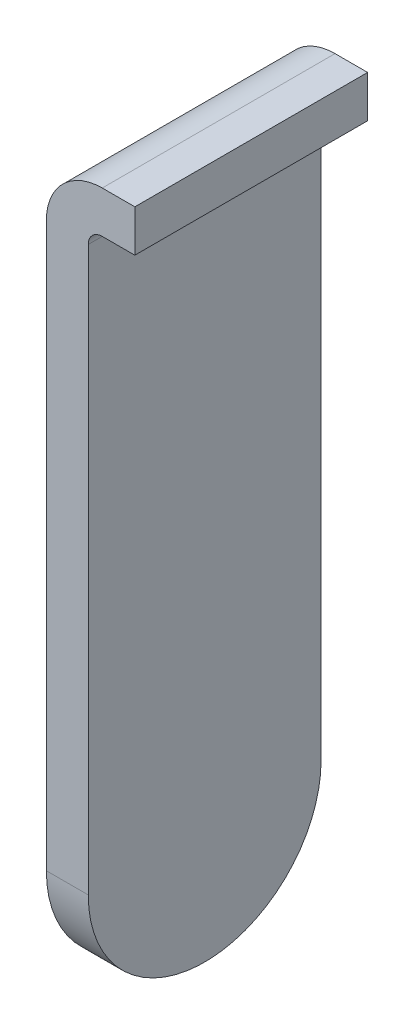
ISO-10303-21;
HEADER;
FILE_DESCRIPTION(('STEP AP214'),'2;1');
FILE_NAME('part.step','',(''),(''),'','','');
FILE_SCHEMA(('AUTOMOTIVE_DESIGN { 1 0 10303 214 1 1 1 1 }'));
ENDSEC;
DATA;
#1=APPLICATION_CONTEXT('core data for automotive mechanical design processes');
#2=APPLICATION_PROTOCOL_DEFINITION('international standard','automotive_design',2000,#1);
#3=PRODUCT_CONTEXT('',#1,'mechanical');
#4=PRODUCT('Part','Part','',(#3));
#5=PRODUCT_RELATED_PRODUCT_CATEGORY('part','',(#4));
#6=PRODUCT_DEFINITION_FORMATION('','',#4);
#7=PRODUCT_DEFINITION_CONTEXT('part definition',#1,'design');
#8=PRODUCT_DEFINITION('design','',#6,#7);
#9=PRODUCT_DEFINITION_SHAPE('','',#8);
#10=(LENGTH_UNIT() NAMED_UNIT(*) SI_UNIT(.MILLI.,.METRE.));
#11=(NAMED_UNIT(*) PLANE_ANGLE_UNIT() SI_UNIT($,.RADIAN.));
#12=(NAMED_UNIT(*) SI_UNIT($,.STERADIAN.) SOLID_ANGLE_UNIT());
#13=UNCERTAINTY_MEASURE_WITH_UNIT(LENGTH_MEASURE(1.E-05),#10,'distance_accuracy_value','');
#14=(GEOMETRIC_REPRESENTATION_CONTEXT(3) GLOBAL_UNCERTAINTY_ASSIGNED_CONTEXT((#13)) GLOBAL_UNIT_ASSIGNED_CONTEXT((#10,
#11,#12)) REPRESENTATION_CONTEXT('',''));
#15=CARTESIAN_POINT('',(0.,0.,0.));
#16=DIRECTION('',(0.,0.,1.));
#17=DIRECTION('',(1.,0.,0.));
#18=AXIS2_PLACEMENT_3D('',#15,#16,#17);
#19=CARTESIAN_POINT('',(-0.35,-0.45,0.));
#20=DIRECTION('',(0.,-1.,0.));
#21=DIRECTION('',(0.,0.,-1.));
#22=AXIS2_PLACEMENT_3D('',#19,#20,#21);
#23=PLANE('',#22);
#24=DIRECTION('',(1.,0.,0.));
#25=VECTOR('',#24,1.);
#26=CARTESIAN_POINT('',(-0.35,-0.45,2.5));
#27=LINE('',#26,#25);
#28=CARTESIAN_POINT('',(0.,-0.45,2.5));
#29=VERTEX_POINT('',#28);
#30=CARTESIAN_POINT('',(-0.35,-0.45,2.5));
#31=VERTEX_POINT('',#30);
#32=EDGE_CURVE('E141',#29,#31,#27,.F.);
#33=ORIENTED_EDGE('',*,*,#32,.T.);
#34=DIRECTION('',(0.,0.,1.));
#35=VECTOR('',#34,1.);
#36=CARTESIAN_POINT('',(-0.35,-0.45,0.));
#37=LINE('',#36,#35);
#38=CARTESIAN_POINT('',(-0.35,-0.45,0.));
#39=VERTEX_POINT('',#38);
#40=EDGE_CURVE('E122',#31,#39,#37,.F.);
#41=ORIENTED_EDGE('',*,*,#40,.T.);
#42=DIRECTION('',(1.,0.,0.));
#43=VECTOR('',#42,1.);
#44=CARTESIAN_POINT('',(-0.35,-0.45,0.));
#45=LINE('',#44,#43);
#46=CARTESIAN_POINT('',(0.,-0.45,0.));
#47=VERTEX_POINT('',#46);
#48=EDGE_CURVE('E139',#39,#47,#45,.T.);
#49=ORIENTED_EDGE('',*,*,#48,.T.);
#50=DIRECTION('',(0.,0.,-1.));
#51=VECTOR('',#50,1.);
#52=CARTESIAN_POINT('',(0.,-0.45,0.));
#53=LINE('',#52,#51);
#54=EDGE_CURVE('E134',#29,#47,#53,.T.);
#55=ORIENTED_EDGE('',*,*,#54,.F.);
#56=EDGE_LOOP('',(#33,#41,#49,#55));
#57=FACE_BOUND('',#56,.T.);
#58=ADVANCED_FACE('F16',(#57),#23,.T.);
#59=CARTESIAN_POINT('',(0.,-0.45,0.));
#60=DIRECTION('',(1.,0.,0.));
#61=DIRECTION('',(0.,0.,-1.));
#62=AXIS2_PLACEMENT_3D('',#59,#60,#61);
#63=PLANE('',#62);
#64=DIRECTION('',(0.,1.,0.));
#65=VECTOR('',#64,1.);
#66=CARTESIAN_POINT('',(0.,-0.45,2.5));
#67=LINE('',#66,#65);
#68=CARTESIAN_POINT('',(0.,0.,2.5));
#69=VERTEX_POINT('',#68);
#70=EDGE_CURVE('E71',#69,#29,#67,.F.);
#71=ORIENTED_EDGE('',*,*,#70,.T.);
#72=ORIENTED_EDGE('',*,*,#54,.T.);
#73=DIRECTION('',(0.,1.,0.));
#74=VECTOR('',#73,1.);
#75=CARTESIAN_POINT('',(0.,-0.45,0.));
#76=LINE('',#75,#74);
#77=CARTESIAN_POINT('',(0.,0.,0.));
#78=VERTEX_POINT('',#77);
#79=EDGE_CURVE('E145',#47,#78,#76,.T.);
#80=ORIENTED_EDGE('',*,*,#79,.T.);
#81=DIRECTION('',(0.,0.,1.));
#82=VECTOR('',#81,1.);
#83=CARTESIAN_POINT('',(0.,0.,0.));
#84=LINE('',#83,#82);
#85=EDGE_CURVE('E127',#69,#78,#84,.F.);
#86=ORIENTED_EDGE('',*,*,#85,.F.);
#87=EDGE_LOOP('',(#71,#72,#80,#86));
#88=FACE_BOUND('',#87,.T.);
#89=ADVANCED_FACE('F177',(#88),#63,.T.);
#90=CARTESIAN_POINT('',(-0.35,-0.6,0.));
#91=DIRECTION('',(0.,0.,1.));
#92=DIRECTION('',(1.,0.,0.));
#93=AXIS2_PLACEMENT_3D('',#90,#91,#92);
#94=CYLINDRICAL_SURFACE('',#93,0.15);
#95=ORIENTED_EDGE('',*,*,#40,.F.);
#96=CARTESIAN_POINT('',(-0.35,-0.6,2.5));
#97=DIRECTION('',(0.,0.,1.));
#98=DIRECTION('',(1.,0.,0.));
#99=AXIS2_PLACEMENT_3D('',#96,#97,#98);
#100=CIRCLE('',#99,0.15);
#101=CARTESIAN_POINT('',(-0.499999999999998,-0.6,2.5));
#102=VERTEX_POINT('',#101);
#103=EDGE_CURVE('E19',#102,#31,#100,.F.);
#104=ORIENTED_EDGE('',*,*,#103,.F.);
#105=DIRECTION('',(0.,0.,-1.));
#106=VECTOR('',#105,1.);
#107=CARTESIAN_POINT('',(-0.499999999999997,-0.6,0.));
#108=LINE('',#107,#106);
#109=CARTESIAN_POINT('',(-0.499999999999998,-0.6,0.));
#110=VERTEX_POINT('',#109);
#111=EDGE_CURVE('E119',#110,#102,#108,.F.);
#112=ORIENTED_EDGE('',*,*,#111,.F.);
#113=CARTESIAN_POINT('',(-0.35,-0.6,0.));
#114=DIRECTION('',(0.,0.,1.));
#115=DIRECTION('',(1.,0.,0.));
#116=AXIS2_PLACEMENT_3D('',#113,#114,#115);
#117=CIRCLE('',#116,0.15);
#118=EDGE_CURVE('E120',#39,#110,#117,.T.);
#119=ORIENTED_EDGE('',*,*,#118,.F.);
#120=EDGE_LOOP('',(#95,#104,#112,#119));
#121=FACE_BOUND('',#120,.T.);
#122=ADVANCED_FACE('F179',(#121),#94,.F.);
#123=CARTESIAN_POINT('',(0.,0.,0.));
#124=DIRECTION('',(0.,1.,0.));
#125=DIRECTION('',(0.,0.,1.));
#126=AXIS2_PLACEMENT_3D('',#123,#124,#125);
#127=PLANE('',#126);
#128=DIRECTION('',(1.,0.,0.));
#129=VECTOR('',#128,1.);
#130=CARTESIAN_POINT('',(-0.68076366226861,0.,2.5));
#131=LINE('',#130,#129);
#132=CARTESIAN_POINT('',(-0.35,0.,2.5));
#133=VERTEX_POINT('',#132);
#134=EDGE_CURVE('E118',#69,#133,#131,.F.);
#135=ORIENTED_EDGE('',*,*,#134,.F.);
#136=ORIENTED_EDGE('',*,*,#85,.T.);
#137=DIRECTION('',(1.,0.,0.));
#138=VECTOR('',#137,1.);
#139=CARTESIAN_POINT('',(0.,0.,0.));
#140=LINE('',#139,#138);
#141=CARTESIAN_POINT('',(-0.35,0.,0.));
#142=VERTEX_POINT('',#141);
#143=EDGE_CURVE('E121',#78,#142,#140,.F.);
#144=ORIENTED_EDGE('',*,*,#143,.T.);
#145=DIRECTION('',(0.,0.,1.));
#146=VECTOR('',#145,1.);
#147=CARTESIAN_POINT('',(-0.350000000000001,0.,0.));
#148=LINE('',#147,#146);
#149=EDGE_CURVE('E117',#133,#142,#148,.F.);
#150=ORIENTED_EDGE('',*,*,#149,.F.);
#151=EDGE_LOOP('',(#135,#136,#144,#150));
#152=FACE_BOUND('',#151,.T.);
#153=ADVANCED_FACE('F176',(#152),#127,.T.);
#154=CARTESIAN_POINT('',(-0.499999999999997,-7.9,0.));
#155=DIRECTION('',(1.,0.,0.));
#156=DIRECTION('',(0.,0.,-1.));
#157=AXIS2_PLACEMENT_3D('',#154,#155,#156);
#158=PLANE('',#157);
#159=ORIENTED_EDGE('',*,*,#111,.T.);
#160=DIRECTION('',(0.,1.,0.));
#161=VECTOR('',#160,1.);
#162=CARTESIAN_POINT('',(-0.499999999999998,-3.8696248652523,2.5));
#163=LINE('',#162,#161);
#164=CARTESIAN_POINT('',(-0.499999999999998,-6.65,2.5));
#165=VERTEX_POINT('',#164);
#166=EDGE_CURVE('E96',#165,#102,#163,.T.);
#167=ORIENTED_EDGE('',*,*,#166,.F.);
#168=CARTESIAN_POINT('',(-0.499999999999998,-6.65,1.25));
#169=DIRECTION('',(1.,0.,0.));
#170=DIRECTION('',(0.,0.,-1.));
#171=AXIS2_PLACEMENT_3D('',#168,#169,#170);
#172=CIRCLE('',#171,1.25);
#173=CARTESIAN_POINT('',(-0.499999999999998,-6.65,0.));
#174=VERTEX_POINT('',#173);
#175=EDGE_CURVE('E93',#174,#165,#172,.F.);
#176=ORIENTED_EDGE('',*,*,#175,.F.);
#177=DIRECTION('',(0.,1.,0.));
#178=VECTOR('',#177,1.);
#179=CARTESIAN_POINT('',(-0.499999999999998,-3.8696248652523,0.));
#180=LINE('',#179,#178);
#181=EDGE_CURVE('E115',#174,#110,#180,.T.);
#182=ORIENTED_EDGE('',*,*,#181,.T.);
#183=EDGE_LOOP('',(#159,#167,#176,#182));
#184=FACE_BOUND('',#183,.T.);
#185=ADVANCED_FACE('F170',(#184),#158,.T.);
#186=CARTESIAN_POINT('',(-0.815381831134304,-6.65,1.25));
#187=DIRECTION('',(1.,0.,0.));
#188=DIRECTION('',(0.,0.,-1.));
#189=AXIS2_PLACEMENT_3D('',#186,#187,#188);
#190=CYLINDRICAL_SURFACE('',#189,1.25);
#191=CARTESIAN_POINT('',(-0.949999999999998,-6.65,1.25));
#192=DIRECTION('',(1.,0.,0.));
#193=DIRECTION('',(0.,0.,-1.));
#194=AXIS2_PLACEMENT_3D('',#191,#192,#193);
#195=CIRCLE('',#194,1.25);
#196=CARTESIAN_POINT('',(-0.95,-6.65,0.));
#197=VERTEX_POINT('',#196);
#198=CARTESIAN_POINT('',(-0.95,-6.65,2.5));
#199=VERTEX_POINT('',#198);
#200=EDGE_CURVE('E91',#197,#199,#195,.F.);
#201=ORIENTED_EDGE('',*,*,#200,.F.);
#202=DIRECTION('',(1.,0.,0.));
#203=VECTOR('',#202,1.);
#204=CARTESIAN_POINT('',(-0.68076366226861,-6.65,0.));
#205=LINE('',#204,#203);
#206=EDGE_CURVE('E107',#197,#174,#205,.T.);
#207=ORIENTED_EDGE('',*,*,#206,.T.);
#208=ORIENTED_EDGE('',*,*,#175,.T.);
#209=DIRECTION('',(1.,0.,0.));
#210=VECTOR('',#209,1.);
#211=CARTESIAN_POINT('',(-0.68076366226861,-6.65,2.5));
#212=LINE('',#211,#210);
#213=EDGE_CURVE('E86',#199,#165,#212,.T.);
#214=ORIENTED_EDGE('',*,*,#213,.F.);
#215=EDGE_LOOP('',(#201,#207,#208,#214));
#216=FACE_BOUND('',#215,.T.);
#217=ADVANCED_FACE('F88',(#216),#190,.T.);
#218=CARTESIAN_POINT('',(-0.68076366226861,-3.8696248652523,2.5));
#219=DIRECTION('',(0.,0.,1.));
#220=DIRECTION('',(1.,0.,0.));
#221=AXIS2_PLACEMENT_3D('',#218,#219,#220);
#222=PLANE('',#221);
#223=CARTESIAN_POINT('',(-0.35,-0.6,2.5));
#224=DIRECTION('',(0.,0.,1.));
#225=DIRECTION('',(1.,0.,0.));
#226=AXIS2_PLACEMENT_3D('',#223,#224,#225);
#227=CIRCLE('',#226,0.6);
#228=CARTESIAN_POINT('',(-0.950000000000001,-0.6,2.5));
#229=VERTEX_POINT('',#228);
#230=EDGE_CURVE('E102',#229,#133,#227,.F.);
#231=ORIENTED_EDGE('',*,*,#230,.F.);
#232=DIRECTION('',(0.,1.,0.));
#233=VECTOR('',#232,1.);
#234=CARTESIAN_POINT('',(-0.950000000000001,-0.600000000000001,2.5));
#235=LINE('',#234,#233);
#236=EDGE_CURVE('E99',#199,#229,#235,.T.);
#237=ORIENTED_EDGE('',*,*,#236,.F.);
#238=ORIENTED_EDGE('',*,*,#213,.T.);
#239=ORIENTED_EDGE('',*,*,#166,.T.);
#240=ORIENTED_EDGE('',*,*,#103,.T.);
#241=ORIENTED_EDGE('',*,*,#32,.F.);
#242=ORIENTED_EDGE('',*,*,#70,.F.);
#243=ORIENTED_EDGE('',*,*,#134,.T.);
#244=EDGE_LOOP('',(#231,#237,#238,#239,#240,#241,#242,#243));
#245=FACE_BOUND('',#244,.T.);
#246=ADVANCED_FACE('F100',(#245),#222,.T.);
#247=CARTESIAN_POINT('',(-0.35,-0.6,0.));
#248=DIRECTION('',(0.,0.,1.));
#249=DIRECTION('',(1.,0.,0.));
#250=AXIS2_PLACEMENT_3D('',#247,#248,#249);
#251=CYLINDRICAL_SURFACE('',#250,0.6);
#252=ORIENTED_EDGE('',*,*,#230,.T.);
#253=ORIENTED_EDGE('',*,*,#149,.T.);
#254=CARTESIAN_POINT('',(-0.35,-0.6,0.));
#255=DIRECTION('',(0.,0.,1.));
#256=DIRECTION('',(1.,0.,0.));
#257=AXIS2_PLACEMENT_3D('',#254,#255,#256);
#258=CIRCLE('',#257,0.6);
#259=CARTESIAN_POINT('',(-0.950000000000001,-0.6,0.));
#260=VERTEX_POINT('',#259);
#261=EDGE_CURVE('E34',#142,#260,#258,.T.);
#262=ORIENTED_EDGE('',*,*,#261,.T.);
#263=DIRECTION('',(0.,0.,1.));
#264=VECTOR('',#263,1.);
#265=CARTESIAN_POINT('',(-0.950000000000001,-0.6,0.));
#266=LINE('',#265,#264);
#267=EDGE_CURVE('E25',#229,#260,#266,.F.);
#268=ORIENTED_EDGE('',*,*,#267,.F.);
#269=EDGE_LOOP('',(#252,#253,#262,#268));
#270=FACE_BOUND('',#269,.T.);
#271=ADVANCED_FACE('F172',(#270),#251,.T.);
#272=CARTESIAN_POINT('',(-0.68076366226861,-3.8696248652523,0.));
#273=DIRECTION('',(0.,0.,1.));
#274=DIRECTION('',(1.,0.,0.));
#275=AXIS2_PLACEMENT_3D('',#272,#273,#274);
#276=PLANE('',#275);
#277=DIRECTION('',(0.,1.,0.));
#278=VECTOR('',#277,1.);
#279=CARTESIAN_POINT('',(-0.950000000000001,-0.600000000000001,0.));
#280=LINE('',#279,#278);
#281=EDGE_CURVE('E11',#260,#197,#280,.F.);
#282=ORIENTED_EDGE('',*,*,#281,.F.);
#283=ORIENTED_EDGE('',*,*,#261,.F.);
#284=ORIENTED_EDGE('',*,*,#143,.F.);
#285=ORIENTED_EDGE('',*,*,#79,.F.);
#286=ORIENTED_EDGE('',*,*,#48,.F.);
#287=ORIENTED_EDGE('',*,*,#118,.T.);
#288=ORIENTED_EDGE('',*,*,#181,.F.);
#289=ORIENTED_EDGE('',*,*,#206,.F.);
#290=EDGE_LOOP('',(#282,#283,#284,#285,#286,#287,#288,#289));
#291=FACE_BOUND('',#290,.T.);
#292=ADVANCED_FACE('F171',(#291),#276,.F.);
#293=CARTESIAN_POINT('',(-0.950000000000001,-0.600000000000001,0.));
#294=DIRECTION('',(-1.,0.,0.));
#295=DIRECTION('',(0.,0.,1.));
#296=AXIS2_PLACEMENT_3D('',#293,#294,#295);
#297=PLANE('',#296);
#298=ORIENTED_EDGE('',*,*,#267,.T.);
#299=ORIENTED_EDGE('',*,*,#281,.T.);
#300=ORIENTED_EDGE('',*,*,#200,.T.);
#301=ORIENTED_EDGE('',*,*,#236,.T.);
#302=EDGE_LOOP('',(#298,#299,#300,#301));
#303=FACE_BOUND('',#302,.T.);
#304=ADVANCED_FACE('F106',(#303),#297,.T.);
#305=CLOSED_SHELL('',(#58,#89,#122,#153,#185,#217,#246,#271,#292,#304));
#306=MANIFOLD_SOLID_BREP('B1',#305);
#307=ADVANCED_BREP_SHAPE_REPRESENTATION('',(#18,#306),#14);
#308=SHAPE_DEFINITION_REPRESENTATION(#9,#307);
ENDSEC;
END-ISO-10303-21;
